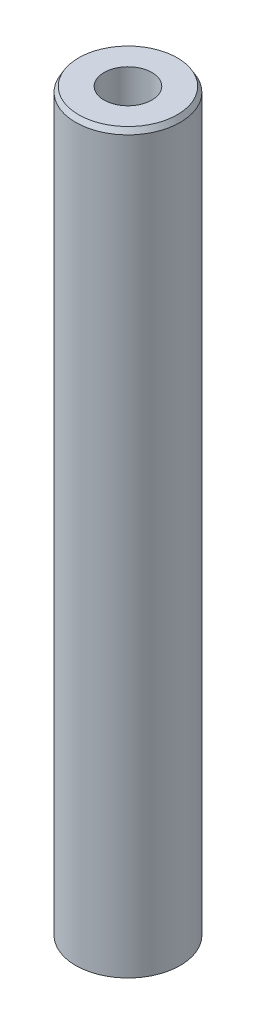
ISO-10303-21;
HEADER;
FILE_DESCRIPTION(('STEP AP214'),'2;1');
FILE_NAME('part.step','',(''),(''),'','','');
FILE_SCHEMA(('AUTOMOTIVE_DESIGN { 1 0 10303 214 1 1 1 1 }'));
ENDSEC;
DATA;
#1=APPLICATION_CONTEXT('core data for automotive mechanical design processes');
#2=APPLICATION_PROTOCOL_DEFINITION('international standard','automotive_design',2000,#1);
#3=PRODUCT_CONTEXT('',#1,'mechanical');
#4=PRODUCT('Part','Part','',(#3));
#5=PRODUCT_RELATED_PRODUCT_CATEGORY('part','',(#4));
#6=PRODUCT_DEFINITION_FORMATION('','',#4);
#7=PRODUCT_DEFINITION_CONTEXT('part definition',#1,'design');
#8=PRODUCT_DEFINITION('design','',#6,#7);
#9=PRODUCT_DEFINITION_SHAPE('','',#8);
#10=(LENGTH_UNIT() NAMED_UNIT(*) SI_UNIT(.MILLI.,.METRE.));
#11=(NAMED_UNIT(*) PLANE_ANGLE_UNIT() SI_UNIT($,.RADIAN.));
#12=(NAMED_UNIT(*) SI_UNIT($,.STERADIAN.) SOLID_ANGLE_UNIT());
#13=UNCERTAINTY_MEASURE_WITH_UNIT(LENGTH_MEASURE(1.E-05),#10,'distance_accuracy_value','');
#14=(GEOMETRIC_REPRESENTATION_CONTEXT(3) GLOBAL_UNCERTAINTY_ASSIGNED_CONTEXT((#13)) GLOBAL_UNIT_ASSIGNED_CONTEXT((#10,
#11,#12)) REPRESENTATION_CONTEXT('',''));
#15=CARTESIAN_POINT('',(0.,0.,0.));
#16=DIRECTION('',(0.,0.,1.));
#17=DIRECTION('',(1.,0.,0.));
#18=AXIS2_PLACEMENT_3D('',#15,#16,#17);
#19=CARTESIAN_POINT('',(0.,600.,0.));
#20=DIRECTION('',(0.,-1.,0.));
#21=DIRECTION('',(0.,0.,-1.));
#22=AXIS2_PLACEMENT_3D('',#19,#20,#21);
#23=CYLINDRICAL_SURFACE('',#22,42.5);
#24=CARTESIAN_POINT('',(0.,595.83097916367,0.));
#25=DIRECTION('',(0.,1.,0.));
#26=DIRECTION('',(0.,0.,1.));
#27=AXIS2_PLACEMENT_3D('',#24,#25,#26);
#28=CIRCLE('',#27,42.5);
#29=CARTESIAN_POINT('',(0.,595.83097916367,42.5));
#30=VERTEX_POINT('',#29);
#31=EDGE_CURVE('E50',#30,#30,#28,.F.);
#32=ORIENTED_EDGE('',*,*,#31,.T.);
#33=EDGE_LOOP('',(#32));
#34=FACE_BOUND('',#33,.T.);
#35=CARTESIAN_POINT('',(0.,2.40698530211214,0.));
#36=DIRECTION('',(0.,1.,0.));
#37=DIRECTION('',(0.,0.,1.));
#38=AXIS2_PLACEMENT_3D('',#35,#36,#37);
#39=CIRCLE('',#38,42.5);
#40=CARTESIAN_POINT('',(0.,2.40698530211214,42.5));
#41=VERTEX_POINT('',#40);
#42=EDGE_CURVE('E51',#41,#41,#39,.T.);
#43=ORIENTED_EDGE('',*,*,#42,.T.);
#44=EDGE_LOOP('',(#43));
#45=FACE_BOUND('',#44,.T.);
#46=ADVANCED_FACE('F39',(#34,#45),#23,.T.);
#47=CARTESIAN_POINT('',(0.,600.,0.));
#48=DIRECTION('',(0.,1.,0.));
#49=DIRECTION('',(0.,0.,1.));
#50=AXIS2_PLACEMENT_3D('',#47,#48,#49);
#51=PLANE('',#50);
#52=CARTESIAN_POINT('',(0.,600.,0.));
#53=DIRECTION('',(0.,1.,0.));
#54=DIRECTION('',(0.,0.,1.));
#55=AXIS2_PLACEMENT_3D('',#52,#53,#54);
#56=CIRCLE('',#55,40.0930146978879);
#57=CARTESIAN_POINT('',(0.,600.,40.0930146978879));
#58=VERTEX_POINT('',#57);
#59=EDGE_CURVE('E54',#58,#58,#56,.T.);
#60=ORIENTED_EDGE('',*,*,#59,.T.);
#61=EDGE_LOOP('',(#60));
#62=FACE_BOUND('',#61,.T.);
#63=CARTESIAN_POINT('',(0.,600.,0.));
#64=DIRECTION('',(0.,1.,0.));
#65=DIRECTION('',(0.,0.,1.));
#66=AXIS2_PLACEMENT_3D('',#63,#64,#65);
#67=CIRCLE('',#66,19.4495560885306);
#68=CARTESIAN_POINT('',(0.,600.,19.4495560885306));
#69=VERTEX_POINT('',#68);
#70=EDGE_CURVE('E58',#69,#69,#67,.T.);
#71=ORIENTED_EDGE('',*,*,#70,.F.);
#72=EDGE_LOOP('',(#71));
#73=FACE_BOUND('',#72,.T.);
#74=ADVANCED_FACE('F69',(#62,#73),#51,.T.);
#75=CARTESIAN_POINT('',(0.,0.,0.));
#76=DIRECTION('',(0.,1.,0.));
#77=DIRECTION('',(0.,0.,1.));
#78=AXIS2_PLACEMENT_3D('',#75,#76,#77);
#79=PLANE('',#78);
#80=CARTESIAN_POINT('',(0.,0.,0.));
#81=DIRECTION('',(0.,1.,0.));
#82=DIRECTION('',(0.,0.,1.));
#83=AXIS2_PLACEMENT_3D('',#80,#81,#82);
#84=CIRCLE('',#83,38.3309791636703);
#85=CARTESIAN_POINT('',(0.,0.,38.3309791636703));
#86=VERTEX_POINT('',#85);
#87=EDGE_CURVE('E10',#86,#86,#84,.F.);
#88=ORIENTED_EDGE('',*,*,#87,.T.);
#89=EDGE_LOOP('',(#88));
#90=FACE_BOUND('',#89,.T.);
#91=CARTESIAN_POINT('',(0.,0.,0.));
#92=DIRECTION('',(0.,1.,0.));
#93=DIRECTION('',(0.,0.,1.));
#94=AXIS2_PLACEMENT_3D('',#91,#92,#93);
#95=CIRCLE('',#94,19.4495560885306);
#96=CARTESIAN_POINT('',(0.,0.,19.4495560885306));
#97=VERTEX_POINT('',#96);
#98=EDGE_CURVE('E63',#97,#97,#95,.T.);
#99=ORIENTED_EDGE('',*,*,#98,.T.);
#100=EDGE_LOOP('',(#99));
#101=FACE_BOUND('',#100,.T.);
#102=ADVANCED_FACE('F75',(#90,#101),#79,.F.);
#103=CARTESIAN_POINT('',(0.,600.,0.));
#104=DIRECTION('',(0.,-1.,0.));
#105=DIRECTION('',(0.,0.,-1.));
#106=AXIS2_PLACEMENT_3D('',#103,#104,#105);
#107=CYLINDRICAL_SURFACE('',#106,19.4495560885306);
#108=ORIENTED_EDGE('',*,*,#70,.T.);
#109=EDGE_LOOP('',(#108));
#110=FACE_BOUND('',#109,.T.);
#111=ORIENTED_EDGE('',*,*,#98,.F.);
#112=EDGE_LOOP('',(#111));
#113=FACE_BOUND('',#112,.T.);
#114=ADVANCED_FACE('F70',(#110,#113),#107,.F.);
#115=CARTESIAN_POINT('',(0.,600.,0.));
#116=DIRECTION('',(0.,-1.,0.));
#117=DIRECTION('',(0.,0.,-1.));
#118=AXIS2_PLACEMENT_3D('',#115,#116,#117);
#119=CONICAL_SURFACE('',#118,40.0930146978879,0.523598775598294);
#120=ORIENTED_EDGE('',*,*,#31,.F.);
#121=EDGE_LOOP('',(#120));
#122=FACE_BOUND('',#121,.T.);
#123=ORIENTED_EDGE('',*,*,#59,.F.);
#124=EDGE_LOOP('',(#123));
#125=FACE_BOUND('',#124,.T.);
#126=ADVANCED_FACE('F81',(#122,#125),#119,.T.);
#127=CARTESIAN_POINT('',(0.,2.40698530211214,0.));
#128=DIRECTION('',(0.,1.,0.));
#129=DIRECTION('',(0.,0.,1.));
#130=AXIS2_PLACEMENT_3D('',#127,#128,#129);
#131=CONICAL_SURFACE('',#130,42.5,1.04719755119659);
#132=CARTESIAN_POINT('',(0.,0.,38.3309791636703));
#133=CARTESIAN_POINT('',(0.,0.0250727635636691,38.3744064640487));
#134=CARTESIAN_POINT('',(0.,0.0501455271273368,38.4178337644272));
#135=CARTESIAN_POINT('',(0.,0.100291054254672,38.504688365184));
#136=CARTESIAN_POINT('',(0.,0.12536381781834,38.5481156655625));
#137=CARTESIAN_POINT('',(0.,0.175509344945676,38.6349702663193));
#138=CARTESIAN_POINT('',(0.,0.200582108509344,38.6783975666978));
#139=CARTESIAN_POINT('',(0.,0.250727635636681,38.7652521674546));
#140=CARTESIAN_POINT('',(0.,0.27580039920035,38.8086794678331));
#141=CARTESIAN_POINT('',(0.,0.325945926327686,38.8955340685899));
#142=CARTESIAN_POINT('',(0.,0.351018689891353,38.9389613689684));
#143=CARTESIAN_POINT('',(0.,0.401164217018689,39.0258159697252));
#144=CARTESIAN_POINT('',(0.,0.426236980582358,39.0692432701037));
#145=CARTESIAN_POINT('',(0.,0.476382507709694,39.1560978708605));
#146=CARTESIAN_POINT('',(0.,0.501455271273363,39.199525171239));
#147=CARTESIAN_POINT('',(0.,0.551600798400699,39.2863797719958));
#148=CARTESIAN_POINT('',(0.,0.576673561964366,39.3298070723743));
#149=CARTESIAN_POINT('',(0.,0.626819089091702,39.4166616731312));
#150=CARTESIAN_POINT('',(0.,0.651891852655371,39.4600889735096));
#151=CARTESIAN_POINT('',(0.,0.702037379782708,39.5469435742665));
#152=CARTESIAN_POINT('',(0.,0.727110143346375,39.5903708746449));
#153=CARTESIAN_POINT('',(0.,0.777255670473711,39.6772254754018));
#154=CARTESIAN_POINT('',(0.,0.802328434037379,39.7206527757802));
#155=CARTESIAN_POINT('',(0.,0.852473961164717,39.8075073765371));
#156=CARTESIAN_POINT('',(0.,0.877546724728385,39.8509346769155));
#157=CARTESIAN_POINT('',(0.,0.927692251855721,39.9377892776724));
#158=CARTESIAN_POINT('',(0.,0.952765015419388,39.9812165780508));
#159=CARTESIAN_POINT('',(0.,1.00291054254672,40.0680711788077));
#160=CARTESIAN_POINT('',(0.,1.02798330611039,40.1114984791861));
#161=CARTESIAN_POINT('',(0.,1.07812883323773,40.198353079943));
#162=CARTESIAN_POINT('',(0.,1.1032015968014,40.2417803803214));
#163=CARTESIAN_POINT('',(0.,1.15334712392873,40.3286349810783));
#164=CARTESIAN_POINT('',(0.,1.1784198874924,40.3720622814567));
#165=CARTESIAN_POINT('',(0.,1.22856541461974,40.4589168822136));
#166=CARTESIAN_POINT('',(0.,1.25363817818341,40.502344182592));
#167=CARTESIAN_POINT('',(0.,1.30378370531074,40.5891987833489));
#168=CARTESIAN_POINT('',(0.,1.32885646887441,40.6326260837273));
#169=CARTESIAN_POINT('',(0.,1.37900199600175,40.7194806844842));
#170=CARTESIAN_POINT('',(0.,1.40407475956541,40.7629079848626));
#171=CARTESIAN_POINT('',(0.,1.45422028669275,40.8497625856195));
#172=CARTESIAN_POINT('',(0.,1.47929305025642,40.8931898859979));
#173=CARTESIAN_POINT('',(0.,1.52943857738376,40.9800444867548));
#174=CARTESIAN_POINT('',(0.,1.55451134094742,41.0234717871332));
#175=CARTESIAN_POINT('',(0.,1.60465686807476,41.1103263878901));
#176=CARTESIAN_POINT('',(0.,1.62972963163843,41.1537536882685));
#177=CARTESIAN_POINT('',(0.,1.67987515876577,41.2406082890254));
#178=CARTESIAN_POINT('',(0.,1.70494792232943,41.2840355894038));
#179=CARTESIAN_POINT('',(0.,1.75509344945677,41.3708901901607));
#180=CARTESIAN_POINT('',(0.,1.78016621302044,41.4143174905391));
#181=CARTESIAN_POINT('',(0.,1.83031174014777,41.501172091296));
#182=CARTESIAN_POINT('',(0.,1.85538450371144,41.5445993916744));
#183=CARTESIAN_POINT('',(0.,1.90553003083878,41.6314539924313));
#184=CARTESIAN_POINT('',(0.,1.93060279440245,41.6748812928098));
#185=CARTESIAN_POINT('',(0.,1.98074832152978,41.7617358935666));
#186=CARTESIAN_POINT('',(0.,2.00582108509345,41.8051631939451));
#187=CARTESIAN_POINT('',(0.,2.05596661222079,41.8920177947019));
#188=CARTESIAN_POINT('',(0.,2.08103937578446,41.9354450950804));
#189=CARTESIAN_POINT('',(0.,2.13118490291179,42.0222996958372));
#190=CARTESIAN_POINT('',(0.,2.15625766647546,42.0657269962157));
#191=CARTESIAN_POINT('',(0.,2.2064031936028,42.1525815969725));
#192=CARTESIAN_POINT('',(0.,2.23147595716646,42.196008897351));
#193=CARTESIAN_POINT('',(0.,2.2816214842938,42.2828634981078));
#194=CARTESIAN_POINT('',(0.,2.30669424785747,42.3262907984863));
#195=CARTESIAN_POINT('',(0.,2.3568397749848,42.4131453992431));
#196=CARTESIAN_POINT('',(0.,2.38191253854847,42.4565726996216));
#197=CARTESIAN_POINT('',(0.,2.40698530211214,42.5));
#198=B_SPLINE_CURVE_WITH_KNOTS('',3,(#132,#133,#134,#135,#136,#137,#138,#139,#140,#141,#142,
#143,#144,#145,#146,#147,#148,#149,#150,#151,#152,#153,#154,#155,#156,#157,#158,#159,#160,#161,
#162,#163,#164,#165,#166,#167,#168,#169,#170,#171,#172,#173,#174,#175,#176,#177,#178,#179,#180,
#181,#182,#183,#184,#185,#186,#187,#188,#189,#190,#191,#192,#193,#194,#195,#196,#197),
.UNSPECIFIED.,.F.,.F.,(4,2,2,2,2,2,2,2,2,2,2,2,2,2,2,2,2,2,2,2,2,2,2,2,2,2,2,2,2,2,2,2,4),(0.,
0.150436581382006,0.300873162764018,0.451309744146023,0.601746325528029,0.752182906910041,
0.902619488292047,1.05305606967405,1.20349265105606,1.35392923243807,1.50436581382008,
1.65480239520209,1.80523897658409,1.95567555796611,2.10611213934811,2.25654872073012,
2.40698530211213,2.55742188349413,2.70785846487615,2.85829504625815,3.00873162764016,
3.15916820902217,3.30960479040418,3.46004137178618,3.61047795316819,3.7609145345502,
3.91135111593221,4.06178769731422,4.21222427869622,4.36266086007823,4.51309744146024,
4.66353402284225,4.81397060422426),.UNSPECIFIED.);
#199=EDGE_CURVE('BSEAM45',#86,#41,#198,.T.);
#200=ORIENTED_EDGE('',*,*,#87,.F.);
#201=ORIENTED_EDGE('',*,*,#42,.F.);
#202=ORIENTED_EDGE('',*,*,#199,.T.);
#203=ORIENTED_EDGE('',*,*,#199,.F.);
#204=EDGE_LOOP('',(#200,#202,#201,#203));
#205=FACE_BOUND('',#204,.T.);
#206=ADVANCED_FACE('F45',(#205),#131,.T.);
#207=CLOSED_SHELL('',(#46,#74,#102,#114,#126,#206));
#208=MANIFOLD_SOLID_BREP('B2',#207);
#209=ADVANCED_BREP_SHAPE_REPRESENTATION('',(#18,#208),#14);
#210=SHAPE_DEFINITION_REPRESENTATION(#9,#209);
ENDSEC;
END-ISO-10303-21;
